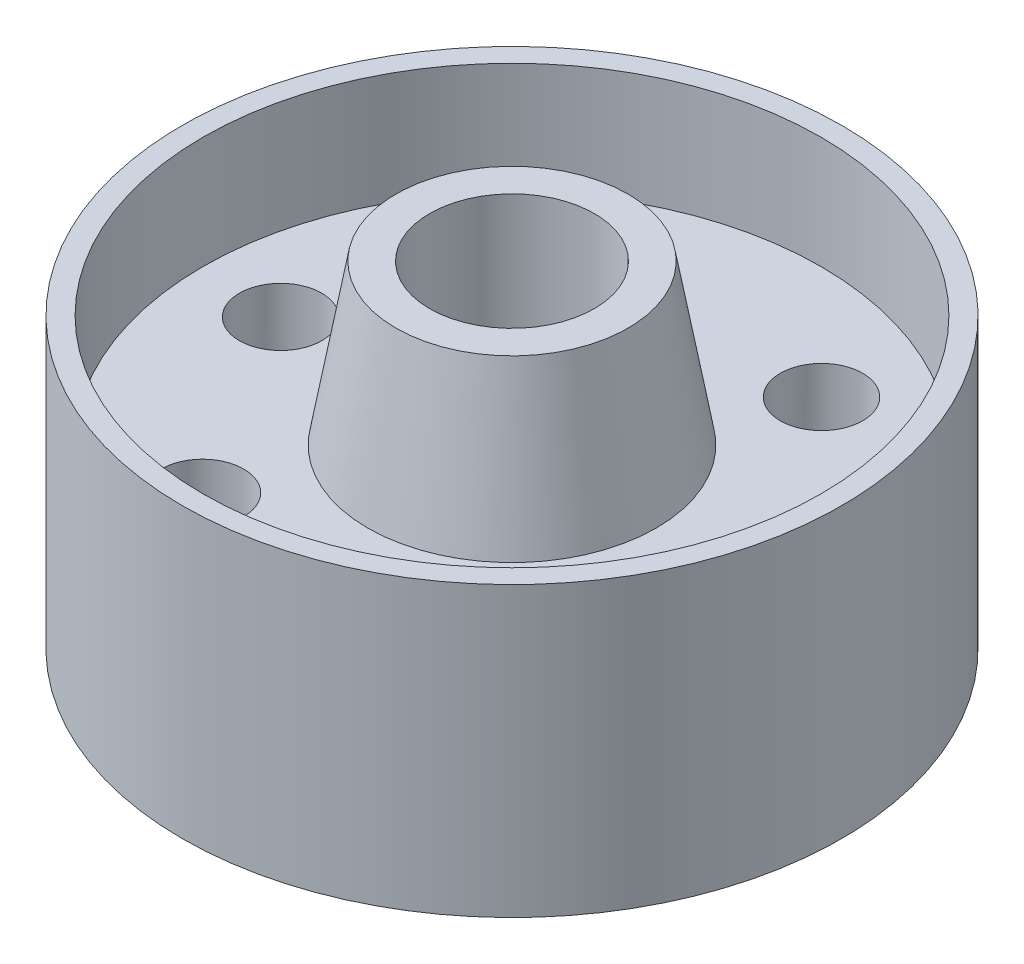
ISO-10303-21;
HEADER;
FILE_DESCRIPTION(('STEP AP214'),'2;1');
FILE_NAME('part.step','',(''),(''),'','','');
FILE_SCHEMA(('AUTOMOTIVE_DESIGN { 1 0 10303 214 1 1 1 1 }'));
ENDSEC;
DATA;
#1=APPLICATION_CONTEXT('core data for automotive mechanical design processes');
#2=APPLICATION_PROTOCOL_DEFINITION('international standard','automotive_design',2000,#1);
#3=PRODUCT_CONTEXT('',#1,'mechanical');
#4=PRODUCT('Part','Part','',(#3));
#5=PRODUCT_RELATED_PRODUCT_CATEGORY('part','',(#4));
#6=PRODUCT_DEFINITION_FORMATION('','',#4);
#7=PRODUCT_DEFINITION_CONTEXT('part definition',#1,'design');
#8=PRODUCT_DEFINITION('design','',#6,#7);
#9=PRODUCT_DEFINITION_SHAPE('','',#8);
#10=(LENGTH_UNIT() NAMED_UNIT(*) SI_UNIT(.MILLI.,.METRE.));
#11=(NAMED_UNIT(*) PLANE_ANGLE_UNIT() SI_UNIT($,.RADIAN.));
#12=(NAMED_UNIT(*) SI_UNIT($,.STERADIAN.) SOLID_ANGLE_UNIT());
#13=UNCERTAINTY_MEASURE_WITH_UNIT(LENGTH_MEASURE(1.E-05),#10,'distance_accuracy_value','');
#14=(GEOMETRIC_REPRESENTATION_CONTEXT(3) GLOBAL_UNCERTAINTY_ASSIGNED_CONTEXT((#13)) GLOBAL_UNIT_ASSIGNED_CONTEXT((#10,
#11,#12)) REPRESENTATION_CONTEXT('',''));
#15=CARTESIAN_POINT('',(0.,0.,0.));
#16=DIRECTION('',(0.,0.,1.));
#17=DIRECTION('',(1.,0.,0.));
#18=AXIS2_PLACEMENT_3D('',#15,#16,#17);
#19=CARTESIAN_POINT('',(0.,29.3624,-12.7));
#20=DIRECTION('',(0.,1.,0.));
#21=DIRECTION('',(0.,0.,1.));
#22=AXIS2_PLACEMENT_3D('',#19,#20,#21);
#23=CYLINDRICAL_SURFACE('',#22,50.8);
#24=CARTESIAN_POINT('',(0.,-22.352,-12.7));
#25=DIRECTION('',(0.,1.,0.));
#26=DIRECTION('',(0.,0.,1.));
#27=AXIS2_PLACEMENT_3D('',#24,#25,#26);
#28=CIRCLE('',#27,50.8);
#29=CARTESIAN_POINT('',(0.,-22.352,38.1));
#30=VERTEX_POINT('',#29);
#31=EDGE_CURVE('E107',#30,#30,#28,.T.);
#32=ORIENTED_EDGE('',*,*,#31,.T.);
#33=EDGE_LOOP('',(#32));
#34=FACE_BOUND('',#33,.T.);
#35=CARTESIAN_POINT('',(0.,22.098,-12.7));
#36=DIRECTION('',(0.,1.,0.));
#37=DIRECTION('',(0.,0.,1.));
#38=AXIS2_PLACEMENT_3D('',#35,#36,#37);
#39=CIRCLE('',#38,50.8);
#40=CARTESIAN_POINT('',(0.,22.098,38.1));
#41=VERTEX_POINT('',#40);
#42=EDGE_CURVE('E10',#41,#41,#39,.T.);
#43=ORIENTED_EDGE('',*,*,#42,.F.);
#44=EDGE_LOOP('',(#43));
#45=FACE_BOUND('',#44,.T.);
#46=ADVANCED_FACE('F39',(#34,#45),#23,.T.);
#47=CARTESIAN_POINT('',(0.,22.098,38.1));
#48=DIRECTION('',(0.,1.,0.));
#49=DIRECTION('',(0.,0.,1.));
#50=AXIS2_PLACEMENT_3D('',#47,#48,#49);
#51=PLANE('',#50);
#52=ORIENTED_EDGE('',*,*,#42,.T.);
#53=EDGE_LOOP('',(#52));
#54=FACE_BOUND('',#53,.T.);
#55=CARTESIAN_POINT('',(0.,22.098,-12.7));
#56=DIRECTION('',(0.,1.,0.));
#57=DIRECTION('',(0.,0.,1.));
#58=AXIS2_PLACEMENT_3D('',#55,#56,#57);
#59=CIRCLE('',#58,47.625);
#60=CARTESIAN_POINT('',(0.,22.098,34.925));
#61=VERTEX_POINT('',#60);
#62=EDGE_CURVE('E47',#61,#61,#59,.T.);
#63=ORIENTED_EDGE('',*,*,#62,.F.);
#64=EDGE_LOOP('',(#63));
#65=FACE_BOUND('',#64,.T.);
#66=ADVANCED_FACE('F152',(#54,#65),#51,.T.);
#67=CARTESIAN_POINT('',(0.,29.3624,-12.7));
#68=DIRECTION('',(0.,1.,0.));
#69=DIRECTION('',(0.,0.,1.));
#70=AXIS2_PLACEMENT_3D('',#67,#68,#69);
#71=CYLINDRICAL_SURFACE('',#70,47.625);
#72=ORIENTED_EDGE('',*,*,#62,.T.);
#73=EDGE_LOOP('',(#72));
#74=FACE_BOUND('',#73,.T.);
#75=CARTESIAN_POINT('',(0.,4.826,-12.7));
#76=DIRECTION('',(0.,1.,0.));
#77=DIRECTION('',(0.,0.,1.));
#78=AXIS2_PLACEMENT_3D('',#75,#76,#77);
#79=CIRCLE('',#78,47.625);
#80=CARTESIAN_POINT('',(0.,4.826,34.925));
#81=VERTEX_POINT('',#80);
#82=EDGE_CURVE('E54',#81,#81,#79,.T.);
#83=ORIENTED_EDGE('',*,*,#82,.F.);
#84=EDGE_LOOP('',(#83));
#85=FACE_BOUND('',#84,.T.);
#86=ADVANCED_FACE('F150',(#74,#85),#71,.F.);
#87=CARTESIAN_POINT('',(0.,4.826,34.925));
#88=DIRECTION('',(0.,1.,0.));
#89=DIRECTION('',(0.,0.,1.));
#90=AXIS2_PLACEMENT_3D('',#87,#88,#89);
#91=PLANE('',#90);
#92=CARTESIAN_POINT('',(-17.4624999999999,4.826,-42.9459372271716));
#93=DIRECTION('',(0.,1.,0.));
#94=DIRECTION('',(0.,0.,1.));
#95=AXIS2_PLACEMENT_3D('',#92,#93,#94);
#96=CIRCLE('',#95,6.34999999999999);
#97=CARTESIAN_POINT('',(-17.4624999999999,4.826,-36.5959372271716));
#98=VERTEX_POINT('',#97);
#99=EDGE_CURVE('E83',#98,#98,#96,.T.);
#100=ORIENTED_EDGE('',*,*,#99,.F.);
#101=EDGE_LOOP('',(#100));
#102=FACE_BOUND('',#101,.T.);
#103=CARTESIAN_POINT('',(17.4624999999999,4.826,-42.9459372271716));
#104=DIRECTION('',(0.,1.,0.));
#105=DIRECTION('',(0.,0.,1.));
#106=AXIS2_PLACEMENT_3D('',#103,#104,#105);
#107=CIRCLE('',#106,6.34999999999999);
#108=CARTESIAN_POINT('',(17.4624999999999,4.826,-36.5959372271716));
#109=VERTEX_POINT('',#108);
#110=EDGE_CURVE('E67',#109,#109,#107,.T.);
#111=ORIENTED_EDGE('',*,*,#110,.F.);
#112=EDGE_LOOP('',(#111));
#113=FACE_BOUND('',#112,.T.);
#114=CARTESIAN_POINT('',(34.9155993100035,4.826,-11.8897223788818));
#115=DIRECTION('',(0.,1.,0.));
#116=DIRECTION('',(0.,0.,1.));
#117=AXIS2_PLACEMENT_3D('',#114,#115,#116);
#118=CIRCLE('',#117,6.34999999999999);
#119=CARTESIAN_POINT('',(34.9155993100035,4.826,-5.53972237888182));
#120=VERTEX_POINT('',#119);
#121=EDGE_CURVE('E66',#120,#120,#118,.T.);
#122=ORIENTED_EDGE('',*,*,#121,.F.);
#123=EDGE_LOOP('',(#122));
#124=FACE_BOUND('',#123,.T.);
#125=CARTESIAN_POINT('',(17.4625000000001,4.826,17.5459372271714));
#126=DIRECTION('',(0.,1.,0.));
#127=DIRECTION('',(0.,0.,1.));
#128=AXIS2_PLACEMENT_3D('',#125,#126,#127);
#129=CIRCLE('',#128,6.34999999999999);
#130=CARTESIAN_POINT('',(17.4625000000001,4.826,23.8959372271714));
#131=VERTEX_POINT('',#130);
#132=EDGE_CURVE('E89',#131,#131,#129,.T.);
#133=ORIENTED_EDGE('',*,*,#132,.F.);
#134=EDGE_LOOP('',(#133));
#135=FACE_BOUND('',#134,.T.);
#136=CARTESIAN_POINT('',(-17.4625000000001,4.826,17.5459372271714));
#137=DIRECTION('',(0.,1.,0.));
#138=DIRECTION('',(0.,0.,1.));
#139=AXIS2_PLACEMENT_3D('',#136,#137,#138);
#140=CIRCLE('',#139,6.34999999999999);
#141=CARTESIAN_POINT('',(-17.4625000000001,4.826,23.8959372271714));
#142=VERTEX_POINT('',#141);
#143=EDGE_CURVE('E62',#142,#142,#140,.T.);
#144=ORIENTED_EDGE('',*,*,#143,.F.);
#145=EDGE_LOOP('',(#144));
#146=FACE_BOUND('',#145,.T.);
#147=CARTESIAN_POINT('',(-34.9168791789156,4.826,-11.9468908412391));
#148=DIRECTION('',(0.,1.,0.));
#149=DIRECTION('',(0.,0.,1.));
#150=AXIS2_PLACEMENT_3D('',#147,#148,#149);
#151=CIRCLE('',#150,6.34999999999999);
#152=CARTESIAN_POINT('',(-34.9168791789156,4.826,-5.59689084123912));
#153=VERTEX_POINT('',#152);
#154=EDGE_CURVE('E61',#153,#153,#151,.T.);
#155=ORIENTED_EDGE('',*,*,#154,.F.);
#156=EDGE_LOOP('',(#155));
#157=FACE_BOUND('',#156,.T.);
#158=ORIENTED_EDGE('',*,*,#82,.T.);
#159=EDGE_LOOP('',(#158));
#160=FACE_BOUND('',#159,.T.);
#161=CARTESIAN_POINT('',(0.,4.826,-12.7));
#162=DIRECTION('',(0.,1.,0.));
#163=DIRECTION('',(0.,0.,1.));
#164=AXIS2_PLACEMENT_3D('',#161,#162,#163);
#165=CIRCLE('',#164,22.225);
#166=CARTESIAN_POINT('',(0.,4.826,9.525));
#167=VERTEX_POINT('',#166);
#168=EDGE_CURVE('E139',#167,#167,#165,.T.);
#169=ORIENTED_EDGE('',*,*,#168,.F.);
#170=EDGE_LOOP('',(#169));
#171=FACE_BOUND('',#170,.T.);
#172=ADVANCED_FACE('F147',(#102,#113,#124,#135,#146,#157,#160,#171),#91,.T.);
#173=CARTESIAN_POINT('',(0.,29.3624,-12.7));
#174=DIRECTION('',(0.,-1.,0.));
#175=DIRECTION('',(0.,0.,-1.));
#176=AXIS2_PLACEMENT_3D('',#173,#174,#175);
#177=CONICAL_SURFACE('',#176,17.898570670545,0.174532925199426);
#178=ORIENTED_EDGE('',*,*,#168,.T.);
#179=EDGE_LOOP('',(#178));
#180=FACE_BOUND('',#179,.T.);
#181=CARTESIAN_POINT('',(0.,29.3624,-12.7));
#182=DIRECTION('',(0.,1.,0.));
#183=DIRECTION('',(0.,0.,1.));
#184=AXIS2_PLACEMENT_3D('',#181,#182,#183);
#185=CIRCLE('',#184,17.898570670545);
#186=CARTESIAN_POINT('',(0.,29.3624,5.19857067054499));
#187=VERTEX_POINT('',#186);
#188=EDGE_CURVE('E135',#187,#187,#185,.T.);
#189=ORIENTED_EDGE('',*,*,#188,.F.);
#190=EDGE_LOOP('',(#189));
#191=FACE_BOUND('',#190,.T.);
#192=ADVANCED_FACE('F159',(#180,#191),#177,.T.);
#193=CARTESIAN_POINT('',(0.,29.3624,5.19857067054499));
#194=DIRECTION('',(0.,1.,0.));
#195=DIRECTION('',(0.,0.,1.));
#196=AXIS2_PLACEMENT_3D('',#193,#194,#195);
#197=PLANE('',#196);
#198=ORIENTED_EDGE('',*,*,#188,.T.);
#199=EDGE_LOOP('',(#198));
#200=FACE_BOUND('',#199,.T.);
#201=CARTESIAN_POINT('',(0.,29.3624,-12.7));
#202=DIRECTION('',(0.,1.,0.));
#203=DIRECTION('',(0.,0.,1.));
#204=AXIS2_PLACEMENT_3D('',#201,#202,#203);
#205=CIRCLE('',#204,12.7);
#206=CARTESIAN_POINT('',(0.,29.3624,0.));
#207=VERTEX_POINT('',#206);
#208=EDGE_CURVE('E131',#207,#207,#205,.T.);
#209=ORIENTED_EDGE('',*,*,#208,.F.);
#210=EDGE_LOOP('',(#209));
#211=FACE_BOUND('',#210,.T.);
#212=ADVANCED_FACE('F201',(#200,#211),#197,.T.);
#213=CARTESIAN_POINT('',(0.,29.3624,-12.7));
#214=DIRECTION('',(0.,1.,0.));
#215=DIRECTION('',(0.,0.,1.));
#216=AXIS2_PLACEMENT_3D('',#213,#214,#215);
#217=CYLINDRICAL_SURFACE('',#216,12.7);
#218=ORIENTED_EDGE('',*,*,#208,.T.);
#219=EDGE_LOOP('',(#218));
#220=FACE_BOUND('',#219,.T.);
#221=CARTESIAN_POINT('',(0.,-29.3624,-12.7));
#222=DIRECTION('',(0.,1.,0.));
#223=DIRECTION('',(0.,0.,1.));
#224=AXIS2_PLACEMENT_3D('',#221,#222,#223);
#225=CIRCLE('',#224,12.7);
#226=CARTESIAN_POINT('',(0.,-29.3624,0.));
#227=VERTEX_POINT('',#226);
#228=EDGE_CURVE('E127',#227,#227,#225,.T.);
#229=ORIENTED_EDGE('',*,*,#228,.F.);
#230=EDGE_LOOP('',(#229));
#231=FACE_BOUND('',#230,.T.);
#232=ADVANCED_FACE('F197',(#220,#231),#217,.F.);
#233=CARTESIAN_POINT('',(0.,-29.3624,5.19857067054499));
#234=DIRECTION('',(0.,-1.,0.));
#235=DIRECTION('',(0.,0.,-1.));
#236=AXIS2_PLACEMENT_3D('',#233,#234,#235);
#237=PLANE('',#236);
#238=ORIENTED_EDGE('',*,*,#228,.T.);
#239=EDGE_LOOP('',(#238));
#240=FACE_BOUND('',#239,.T.);
#241=CARTESIAN_POINT('',(0.,-29.3624,-12.7));
#242=DIRECTION('',(0.,1.,0.));
#243=DIRECTION('',(0.,0.,1.));
#244=AXIS2_PLACEMENT_3D('',#241,#242,#243);
#245=CIRCLE('',#244,17.898570670545);
#246=CARTESIAN_POINT('',(0.,-29.3624,5.19857067054499));
#247=VERTEX_POINT('',#246);
#248=EDGE_CURVE('E123',#247,#247,#245,.T.);
#249=ORIENTED_EDGE('',*,*,#248,.F.);
#250=EDGE_LOOP('',(#249));
#251=FACE_BOUND('',#250,.T.);
#252=ADVANCED_FACE('F193',(#240,#251),#237,.T.);
#253=CARTESIAN_POINT('',(0.,-4.826,-12.7));
#254=DIRECTION('',(0.,1.,0.));
#255=DIRECTION('',(0.,0.,1.));
#256=AXIS2_PLACEMENT_3D('',#253,#254,#255);
#257=CONICAL_SURFACE('',#256,22.225,0.174532925199426);
#258=ORIENTED_EDGE('',*,*,#248,.T.);
#259=EDGE_LOOP('',(#258));
#260=FACE_BOUND('',#259,.T.);
#261=CARTESIAN_POINT('',(0.,-4.826,-12.7));
#262=DIRECTION('',(0.,1.,0.));
#263=DIRECTION('',(0.,0.,1.));
#264=AXIS2_PLACEMENT_3D('',#261,#262,#263);
#265=CIRCLE('',#264,22.225);
#266=CARTESIAN_POINT('',(0.,-4.826,9.525));
#267=VERTEX_POINT('',#266);
#268=EDGE_CURVE('E119',#267,#267,#265,.T.);
#269=ORIENTED_EDGE('',*,*,#268,.F.);
#270=EDGE_LOOP('',(#269));
#271=FACE_BOUND('',#270,.T.);
#272=ADVANCED_FACE('F189',(#260,#271),#257,.T.);
#273=CARTESIAN_POINT('',(0.,-4.826,34.925));
#274=DIRECTION('',(0.,-1.,0.));
#275=DIRECTION('',(0.,0.,-1.));
#276=AXIS2_PLACEMENT_3D('',#273,#274,#275);
#277=PLANE('',#276);
#278=CARTESIAN_POINT('',(-17.4624999999999,-4.826,-42.9459372271716));
#279=DIRECTION('',(0.,-1.,0.));
#280=DIRECTION('',(0.,0.,-1.));
#281=AXIS2_PLACEMENT_3D('',#278,#279,#280);
#282=CIRCLE('',#281,6.34999999999999);
#283=CARTESIAN_POINT('',(-17.4624999999999,-4.826,-49.2959372271715));
#284=VERTEX_POINT('',#283);
#285=EDGE_CURVE('E42',#284,#284,#282,.T.);
#286=ORIENTED_EDGE('',*,*,#285,.F.);
#287=EDGE_LOOP('',(#286));
#288=FACE_BOUND('',#287,.T.);
#289=CARTESIAN_POINT('',(17.4624999999999,-4.826,-42.9459372271716));
#290=DIRECTION('',(0.,-1.,0.));
#291=DIRECTION('',(0.,0.,-1.));
#292=AXIS2_PLACEMENT_3D('',#289,#290,#291);
#293=CIRCLE('',#292,6.34999999999999);
#294=CARTESIAN_POINT('',(17.4624999999999,-4.826,-49.2959372271715));
#295=VERTEX_POINT('',#294);
#296=EDGE_CURVE('E63',#295,#295,#293,.T.);
#297=ORIENTED_EDGE('',*,*,#296,.F.);
#298=EDGE_LOOP('',(#297));
#299=FACE_BOUND('',#298,.T.);
#300=CARTESIAN_POINT('',(34.9155993100035,-4.826,-11.8897223788818));
#301=DIRECTION('',(0.,-1.,0.));
#302=DIRECTION('',(0.,0.,-1.));
#303=AXIS2_PLACEMENT_3D('',#300,#301,#302);
#304=CIRCLE('',#303,6.34999999999998);
#305=CARTESIAN_POINT('',(34.9155993100035,-4.826,-18.2397223788818));
#306=VERTEX_POINT('',#305);
#307=EDGE_CURVE('E74',#306,#306,#304,.T.);
#308=ORIENTED_EDGE('',*,*,#307,.F.);
#309=EDGE_LOOP('',(#308));
#310=FACE_BOUND('',#309,.T.);
#311=CARTESIAN_POINT('',(17.4625000000001,-4.826,17.5459372271714));
#312=DIRECTION('',(0.,-1.,0.));
#313=DIRECTION('',(0.,0.,-1.));
#314=AXIS2_PLACEMENT_3D('',#311,#312,#313);
#315=CIRCLE('',#314,6.34999999999999);
#316=CARTESIAN_POINT('',(17.4625000000001,-4.826,11.1959372271715));
#317=VERTEX_POINT('',#316);
#318=EDGE_CURVE('E93',#317,#317,#315,.T.);
#319=ORIENTED_EDGE('',*,*,#318,.F.);
#320=EDGE_LOOP('',(#319));
#321=FACE_BOUND('',#320,.T.);
#322=CARTESIAN_POINT('',(-17.4625000000001,-4.826,17.5459372271714));
#323=DIRECTION('',(0.,-1.,0.));
#324=DIRECTION('',(0.,0.,-1.));
#325=AXIS2_PLACEMENT_3D('',#322,#323,#324);
#326=CIRCLE('',#325,6.34999999999999);
#327=CARTESIAN_POINT('',(-17.4625000000001,-4.826,11.1959372271715));
#328=VERTEX_POINT('',#327);
#329=EDGE_CURVE('E58',#328,#328,#326,.T.);
#330=ORIENTED_EDGE('',*,*,#329,.F.);
#331=EDGE_LOOP('',(#330));
#332=FACE_BOUND('',#331,.T.);
#333=CARTESIAN_POINT('',(-34.9168791789156,-4.826,-11.9468908412391));
#334=DIRECTION('',(0.,-1.,0.));
#335=DIRECTION('',(0.,0.,-1.));
#336=AXIS2_PLACEMENT_3D('',#333,#334,#335);
#337=CIRCLE('',#336,6.34999999999999);
#338=CARTESIAN_POINT('',(-34.9168791789156,-4.826,-18.2968908412391));
#339=VERTEX_POINT('',#338);
#340=EDGE_CURVE('E103',#339,#339,#337,.T.);
#341=ORIENTED_EDGE('',*,*,#340,.F.);
#342=EDGE_LOOP('',(#341));
#343=FACE_BOUND('',#342,.T.);
#344=ORIENTED_EDGE('',*,*,#268,.T.);
#345=EDGE_LOOP('',(#344));
#346=FACE_BOUND('',#345,.T.);
#347=CARTESIAN_POINT('',(0.,-4.826,-12.7));
#348=DIRECTION('',(0.,1.,0.));
#349=DIRECTION('',(0.,0.,1.));
#350=AXIS2_PLACEMENT_3D('',#347,#348,#349);
#351=CIRCLE('',#350,47.625);
#352=CARTESIAN_POINT('',(0.,-4.826,34.925));
#353=VERTEX_POINT('',#352);
#354=EDGE_CURVE('E115',#353,#353,#351,.T.);
#355=ORIENTED_EDGE('',*,*,#354,.F.);
#356=EDGE_LOOP('',(#355));
#357=FACE_BOUND('',#356,.T.);
#358=ADVANCED_FACE('F182',(#288,#299,#310,#321,#332,#343,#346,#357),#277,.T.);
#359=CARTESIAN_POINT('',(0.,29.3624,-12.7));
#360=DIRECTION('',(0.,1.,0.));
#361=DIRECTION('',(0.,0.,1.));
#362=AXIS2_PLACEMENT_3D('',#359,#360,#361);
#363=CYLINDRICAL_SURFACE('',#362,47.625);
#364=ORIENTED_EDGE('',*,*,#354,.T.);
#365=EDGE_LOOP('',(#364));
#366=FACE_BOUND('',#365,.T.);
#367=CARTESIAN_POINT('',(0.,-22.352,-12.7));
#368=DIRECTION('',(0.,1.,0.));
#369=DIRECTION('',(0.,0.,1.));
#370=AXIS2_PLACEMENT_3D('',#367,#368,#369);
#371=CIRCLE('',#370,47.625);
#372=CARTESIAN_POINT('',(0.,-22.352,34.925));
#373=VERTEX_POINT('',#372);
#374=EDGE_CURVE('E111',#373,#373,#371,.T.);
#375=ORIENTED_EDGE('',*,*,#374,.F.);
#376=EDGE_LOOP('',(#375));
#377=FACE_BOUND('',#376,.T.);
#378=ADVANCED_FACE('F172',(#366,#377),#363,.F.);
#379=CARTESIAN_POINT('',(0.,-22.352,34.925));
#380=DIRECTION('',(0.,-1.,0.));
#381=DIRECTION('',(0.,0.,-1.));
#382=AXIS2_PLACEMENT_3D('',#379,#380,#381);
#383=PLANE('',#382);
#384=ORIENTED_EDGE('',*,*,#374,.T.);
#385=EDGE_LOOP('',(#384));
#386=FACE_BOUND('',#385,.T.);
#387=ORIENTED_EDGE('',*,*,#31,.F.);
#388=EDGE_LOOP('',(#387));
#389=FACE_BOUND('',#388,.T.);
#390=ADVANCED_FACE('F169',(#386,#389),#383,.T.);
#391=CARTESIAN_POINT('',(-34.9168791789156,4.826,-11.9468908412391));
#392=DIRECTION('',(0.,1.,0.));
#393=DIRECTION('',(0.,0.,1.));
#394=AXIS2_PLACEMENT_3D('',#391,#392,#393);
#395=CYLINDRICAL_SURFACE('',#394,6.34999999999999);
#396=ORIENTED_EDGE('',*,*,#340,.T.);
#397=EDGE_LOOP('',(#396));
#398=FACE_BOUND('',#397,.T.);
#399=ORIENTED_EDGE('',*,*,#154,.T.);
#400=EDGE_LOOP('',(#399));
#401=FACE_BOUND('',#400,.T.);
#402=ADVANCED_FACE('F171',(#398,#401),#395,.F.);
#403=CARTESIAN_POINT('',(-17.4625000000001,4.826,17.5459372271714));
#404=DIRECTION('',(0.,1.,0.));
#405=DIRECTION('',(0.,0.,1.));
#406=AXIS2_PLACEMENT_3D('',#403,#404,#405);
#407=CYLINDRICAL_SURFACE('',#406,6.34999999999999);
#408=ORIENTED_EDGE('',*,*,#329,.T.);
#409=EDGE_LOOP('',(#408));
#410=FACE_BOUND('',#409,.T.);
#411=ORIENTED_EDGE('',*,*,#143,.T.);
#412=EDGE_LOOP('',(#411));
#413=FACE_BOUND('',#412,.T.);
#414=ADVANCED_FACE('F179',(#410,#413),#407,.F.);
#415=CARTESIAN_POINT('',(17.4625000000001,4.826,17.5459372271714));
#416=DIRECTION('',(0.,1.,0.));
#417=DIRECTION('',(0.,0.,1.));
#418=AXIS2_PLACEMENT_3D('',#415,#416,#417);
#419=CYLINDRICAL_SURFACE('',#418,6.34999999999999);
#420=ORIENTED_EDGE('',*,*,#318,.T.);
#421=EDGE_LOOP('',(#420));
#422=FACE_BOUND('',#421,.T.);
#423=ORIENTED_EDGE('',*,*,#132,.T.);
#424=EDGE_LOOP('',(#423));
#425=FACE_BOUND('',#424,.T.);
#426=ADVANCED_FACE('F272',(#422,#425),#419,.F.);
#427=CARTESIAN_POINT('',(34.9155993100035,4.826,-11.8897223788818));
#428=DIRECTION('',(0.,1.,0.));
#429=DIRECTION('',(0.,0.,1.));
#430=AXIS2_PLACEMENT_3D('',#427,#428,#429);
#431=CYLINDRICAL_SURFACE('',#430,6.34999999999998);
#432=ORIENTED_EDGE('',*,*,#307,.T.);
#433=EDGE_LOOP('',(#432));
#434=FACE_BOUND('',#433,.T.);
#435=ORIENTED_EDGE('',*,*,#121,.T.);
#436=EDGE_LOOP('',(#435));
#437=FACE_BOUND('',#436,.T.);
#438=ADVANCED_FACE('F281',(#434,#437),#431,.F.);
#439=CARTESIAN_POINT('',(17.4624999999999,4.826,-42.9459372271716));
#440=DIRECTION('',(0.,1.,0.));
#441=DIRECTION('',(0.,0.,1.));
#442=AXIS2_PLACEMENT_3D('',#439,#440,#441);
#443=CYLINDRICAL_SURFACE('',#442,6.34999999999999);
#444=ORIENTED_EDGE('',*,*,#296,.T.);
#445=EDGE_LOOP('',(#444));
#446=FACE_BOUND('',#445,.T.);
#447=ORIENTED_EDGE('',*,*,#110,.T.);
#448=EDGE_LOOP('',(#447));
#449=FACE_BOUND('',#448,.T.);
#450=ADVANCED_FACE('F291',(#446,#449),#443,.F.);
#451=CARTESIAN_POINT('',(-17.4624999999999,4.826,-42.9459372271716));
#452=DIRECTION('',(0.,1.,0.));
#453=DIRECTION('',(0.,0.,1.));
#454=AXIS2_PLACEMENT_3D('',#451,#452,#453);
#455=CYLINDRICAL_SURFACE('',#454,6.34999999999999);
#456=ORIENTED_EDGE('',*,*,#285,.T.);
#457=EDGE_LOOP('',(#456));
#458=FACE_BOUND('',#457,.T.);
#459=ORIENTED_EDGE('',*,*,#99,.T.);
#460=EDGE_LOOP('',(#459));
#461=FACE_BOUND('',#460,.T.);
#462=ADVANCED_FACE('F301',(#458,#461),#455,.F.);
#463=CLOSED_SHELL('',(#46,#66,#86,#172,#192,#212,#232,#252,#272,#358,#378,#390,#402,#414,#426,
#438,#450,#462));
#464=MANIFOLD_SOLID_BREP('B2',#463);
#465=ADVANCED_BREP_SHAPE_REPRESENTATION('',(#18,#464),#14);
#466=SHAPE_DEFINITION_REPRESENTATION(#9,#465);
ENDSEC;
END-ISO-10303-21;
